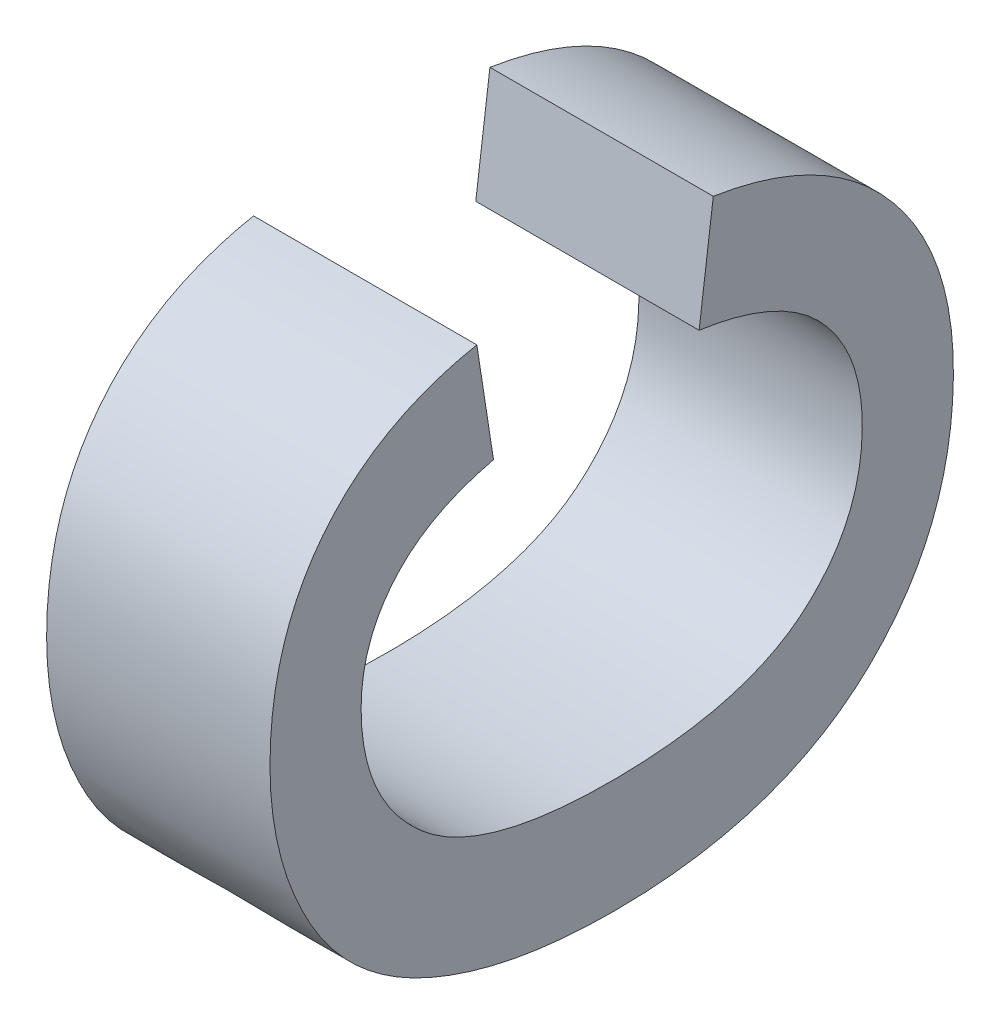
ISO-10303-21;
HEADER;
FILE_DESCRIPTION(('STEP AP214'),'2;1');
FILE_NAME('part.step','',(''),(''),'','','');
FILE_SCHEMA(('AUTOMOTIVE_DESIGN { 1 0 10303 214 1 1 1 1 }'));
ENDSEC;
DATA;
#1=APPLICATION_CONTEXT('core data for automotive mechanical design processes');
#2=APPLICATION_PROTOCOL_DEFINITION('international standard','automotive_design',2000,#1);
#3=PRODUCT_CONTEXT('',#1,'mechanical');
#4=PRODUCT('Part','Part','',(#3));
#5=PRODUCT_RELATED_PRODUCT_CATEGORY('part','',(#4));
#6=PRODUCT_DEFINITION_FORMATION('','',#4);
#7=PRODUCT_DEFINITION_CONTEXT('part definition',#1,'design');
#8=PRODUCT_DEFINITION('design','',#6,#7);
#9=PRODUCT_DEFINITION_SHAPE('','',#8);
#10=(LENGTH_UNIT() NAMED_UNIT(*) SI_UNIT(.MILLI.,.METRE.));
#11=(NAMED_UNIT(*) PLANE_ANGLE_UNIT() SI_UNIT($,.RADIAN.));
#12=(NAMED_UNIT(*) SI_UNIT($,.STERADIAN.) SOLID_ANGLE_UNIT());
#13=UNCERTAINTY_MEASURE_WITH_UNIT(LENGTH_MEASURE(1.E-05),#10,'distance_accuracy_value','');
#14=(GEOMETRIC_REPRESENTATION_CONTEXT(3) GLOBAL_UNCERTAINTY_ASSIGNED_CONTEXT((#13)) GLOBAL_UNIT_ASSIGNED_CONTEXT((#10,
#11,#12)) REPRESENTATION_CONTEXT('',''));
#15=CARTESIAN_POINT('',(0.,0.,0.));
#16=DIRECTION('',(0.,0.,1.));
#17=DIRECTION('',(1.,0.,0.));
#18=AXIS2_PLACEMENT_3D('',#15,#16,#17);
#19=CARTESIAN_POINT('',(4.55229940712888,-37.5062938275421,-8.8544301576874));
#20=DIRECTION('',(-1.,0.,0.));
#21=DIRECTION('',(0.,0.,1.));
#22=AXIS2_PLACEMENT_3D('',#19,#20,#21);
#23=PLANE('',#22);
#24=CARTESIAN_POINT('',(4.55229940712884,-37.2485404965089,-9.00542493597448));
#25=CARTESIAN_POINT('',(4.55229940712884,-37.2726601827609,-9.00914625899622));
#26=CARTESIAN_POINT('',(4.55229940712884,-37.2967798690129,-9.01286758201795));
#27=(BOUNDED_CURVE() B_SPLINE_CURVE(2,(#24,#25,#26),.UNSPECIFIED.,.F.,
.F.) B_SPLINE_CURVE_WITH_KNOTS((3,3),(37.,38.),
.UNSPECIFIED.) CURVE() GEOMETRIC_REPRESENTATION_ITEM() RATIONAL_B_SPLINE_CURVE((1.,1.,1.)) REPRESENTATION_ITEM(''));
#28=CARTESIAN_POINT('',(4.55229940712884,-37.2485404965089,-9.00542493597448));
#29=VERTEX_POINT('',#28);
#30=CARTESIAN_POINT('',(4.55229940712884,-37.2967798690129,-9.01286758201795));
#31=VERTEX_POINT('',#30);
#32=EDGE_CURVE('E68',#29,#31,#27,.T.);
#33=ORIENTED_EDGE('',*,*,#32,.T.);
#34=CARTESIAN_POINT('',(4.55229940712884,-37.2967798690129,-9.01286758201795));
#35=CARTESIAN_POINT('',(4.55229940712885,-37.303671207942,-8.98337265140123));
#36=CARTESIAN_POINT('',(4.55229940712885,-37.321175208822,-8.9684873593143));
#37=CARTESIAN_POINT('',(4.55229940712885,-37.338679209702,-8.95360206722736));
#38=CARTESIAN_POINT('',(4.55229940712885,-37.3634880298469,-8.95360206722736));
#39=CARTESIAN_POINT('',(4.55229940712886,-37.4009769136214,-8.95360206722736));
#40=CARTESIAN_POINT('',(4.55229940712886,-37.4244074659805,-8.980478289051));
#41=CARTESIAN_POINT('',(4.55229940712887,-37.4478380183396,-9.00735451087464));
#42=CARTESIAN_POINT('',(4.55229940712887,-37.4478380183396,-9.06551741143657));
#43=CARTESIAN_POINT('',(4.55229940712887,-37.4478380183396,-9.12450727266999));
#44=CARTESIAN_POINT('',(4.55229940712886,-37.425234426652,-9.15124566771505));
#45=CARTESIAN_POINT('',(4.55229940712886,-37.4026308349644,-9.17798406276011));
#46=CARTESIAN_POINT('',(4.55229940712885,-37.3662445654186,-9.17798406276012));
#47=CARTESIAN_POINT('',(4.55229940712885,-37.337025288359,-9.17798406276011));
#48=CARTESIAN_POINT('',(4.55229940712885,-37.3174538858003,-9.16006658154435));
#49=CARTESIAN_POINT('',(4.55229940712884,-37.2978824832415,-9.14214910032859));
#50=CARTESIAN_POINT('',(4.55229940712884,-37.2926450656554,-9.10493587011124));
#51=(BOUNDED_CURVE() B_SPLINE_CURVE(2,(#34,#35,#36,#37,#38,#39,#40,#41,#42,#43,#44,#45,#46,#47,
#48,#49,#50),.UNSPECIFIED.,.F.,.F.) B_SPLINE_CURVE_WITH_KNOTS((3,2,2,2,2,2,2,2,3),(38.,39.,40.,
41.,42.,43.,44.,45.,46.),
.UNSPECIFIED.) CURVE() GEOMETRIC_REPRESENTATION_ITEM() RATIONAL_B_SPLINE_CURVE((1.,1.,1.,1.,1.,
1.,1.,1.,1.,1.,1.,1.,1.,1.,1.,1.,1.)) REPRESENTATION_ITEM(''));
#52=CARTESIAN_POINT('',(4.55229940712884,-37.2926450656554,-9.10493587011124));
#53=VERTEX_POINT('',#52);
#54=EDGE_CURVE('E108',#31,#53,#51,.T.);
#55=ORIENTED_EDGE('',*,*,#54,.T.);
#56=CARTESIAN_POINT('',(4.55229940712884,-37.2926450656554,-9.10493587011124));
#57=CARTESIAN_POINT('',(4.55229940712884,-37.2682497258462,-9.10810588601865));
#58=CARTESIAN_POINT('',(4.55229940712884,-37.2438543860371,-9.11127590192605));
#59=(BOUNDED_CURVE() B_SPLINE_CURVE(2,(#56,#57,#58),.UNSPECIFIED.,.F.,
.F.) B_SPLINE_CURVE_WITH_KNOTS((3,3),(46.,47.),
.UNSPECIFIED.) CURVE() GEOMETRIC_REPRESENTATION_ITEM() RATIONAL_B_SPLINE_CURVE((1.,1.,1.)) REPRESENTATION_ITEM(''));
#60=CARTESIAN_POINT('',(4.55229940712884,-37.2438543860371,-9.11127590192605));
#61=VERTEX_POINT('',#60);
#62=EDGE_CURVE('E71',#53,#61,#59,.T.);
#63=ORIENTED_EDGE('',*,*,#62,.T.);
#64=CARTESIAN_POINT('',(4.55229940712884,-37.2438543860371,-9.11127590192605));
#65=CARTESIAN_POINT('',(4.55229940712884,-37.2518483391949,-9.16172050288734));
#66=CARTESIAN_POINT('',(4.55229940712884,-37.2847889392762,-9.19025064605398));
#67=CARTESIAN_POINT('',(4.55229940712885,-37.3177295393575,-9.21878078922061));
#68=CARTESIAN_POINT('',(4.55229940712885,-37.3656932583043,-9.21878078922061));
#69=CARTESIAN_POINT('',(4.55229940712886,-37.4257857337664,-9.21878078922061));
#70=CARTESIAN_POINT('',(4.55229940712887,-37.4623098300908,-9.17950015732452));
#71=CARTESIAN_POINT('',(4.55229940712887,-37.4988339264152,-9.14021952542843));
#72=CARTESIAN_POINT('',(4.55229940712887,-37.4988339264152,-9.0668956792224));
#73=CARTESIAN_POINT('',(4.55229940712887,-37.4988339264152,-9.01948326738993));
#74=CARTESIAN_POINT('',(4.55229940712887,-37.4831216736568,-8.98392395851557));
#75=CARTESIAN_POINT('',(4.55229940712887,-37.4674094208983,-8.94836464964121));
#76=CARTESIAN_POINT('',(4.55229940712886,-37.4352957814885,-8.93058499520404));
#77=CARTESIAN_POINT('',(4.55229940712886,-37.4031821420788,-8.91280534076686));
#78=CARTESIAN_POINT('',(4.55229940712885,-37.3654176047471,-8.91280534076686));
#79=CARTESIAN_POINT('',(4.55229940712885,-37.3177295393575,-8.91280534076686));
#80=CARTESIAN_POINT('',(4.55229940712884,-37.2874076480692,-8.93692502701884));
#81=CARTESIAN_POINT('',(4.55229940712884,-37.2570857904301,-8.96104471327083));
#82=CARTESIAN_POINT('',(4.55229940712884,-37.2485404965089,-9.00542493597448));
#83=(BOUNDED_CURVE() B_SPLINE_CURVE(2,(#64,#65,#66,#67,#68,#69,#70,#71,#72,#73,#74,#75,#76,#77,
#78,#79,#80,#81,#82),.UNSPECIFIED.,.F.,.F.) B_SPLINE_CURVE_WITH_KNOTS((3,2,2,2,2,2,2,2,2,3),
(47.,48.,49.,50.,51.,52.,53.,54.,55.,56.),
.UNSPECIFIED.) CURVE() GEOMETRIC_REPRESENTATION_ITEM() RATIONAL_B_SPLINE_CURVE((1.,1.,1.,1.,1.,
1.,1.,1.,1.,1.,1.,1.,1.,1.,1.,1.,1.,1.,1.)) REPRESENTATION_ITEM(''));
#84=EDGE_CURVE('E11',#61,#29,#83,.T.);
#85=ORIENTED_EDGE('',*,*,#84,.T.);
#86=EDGE_LOOP('',(#33,#55,#63,#85));
#87=FACE_BOUND('',#86,.T.);
#88=ADVANCED_FACE('F16',(#87),#23,.T.);
#89=CARTESIAN_POINT('',(4.65229940712888,-37.5062938275421,-8.8544301576874));
#90=DIRECTION('',(1.,0.,0.));
#91=DIRECTION('',(0.,1.,0.));
#92=AXIS2_PLACEMENT_3D('',#89,#90,#91);
#93=PLANE('',#92);
#94=CARTESIAN_POINT('',(4.65229940712884,-37.2438543860371,-9.11127590192605));
#95=CARTESIAN_POINT('',(4.65229940712884,-37.2518483391949,-9.16172050288735));
#96=CARTESIAN_POINT('',(4.65229940712884,-37.2847889392761,-9.19025064605398));
#97=CARTESIAN_POINT('',(4.65229940712885,-37.3177295393574,-9.21878078922061));
#98=CARTESIAN_POINT('',(4.65229940712885,-37.3656932583042,-9.21878078922061));
#99=CARTESIAN_POINT('',(4.65229940712886,-37.4257857337663,-9.21878078922061));
#100=CARTESIAN_POINT('',(4.65229940712887,-37.4623098300908,-9.17950015732453));
#101=CARTESIAN_POINT('',(4.65229940712887,-37.4988339264152,-9.14021952542843));
#102=CARTESIAN_POINT('',(4.65229940712887,-37.4988339264152,-9.0668956792224));
#103=CARTESIAN_POINT('',(4.65229940712887,-37.4988339264152,-9.01948326738993));
#104=CARTESIAN_POINT('',(4.65229940712887,-37.4831216736567,-8.98392395851557));
#105=CARTESIAN_POINT('',(4.65229940712887,-37.4674094208983,-8.94836464964121));
#106=CARTESIAN_POINT('',(4.65229940712887,-37.4352957814885,-8.93058499520404));
#107=CARTESIAN_POINT('',(4.65229940712886,-37.4031821420788,-8.91280534076686));
#108=CARTESIAN_POINT('',(4.65229940712886,-37.3654176047471,-8.91280534076686));
#109=CARTESIAN_POINT('',(4.65229940712885,-37.3177295393574,-8.91280534076686));
#110=CARTESIAN_POINT('',(4.65229940712884,-37.2874076480692,-8.93692502701884));
#111=CARTESIAN_POINT('',(4.65229940712884,-37.2570857904301,-8.96104471327083));
#112=CARTESIAN_POINT('',(4.65229940712884,-37.2485404965089,-9.00542493597448));
#113=(BOUNDED_CURVE() B_SPLINE_CURVE(2,(#94,#95,#96,#97,#98,#99,#100,#101,#102,#103,#104,#105,
#106,#107,#108,#109,#110,#111,#112),.UNSPECIFIED.,.F.,.F.) B_SPLINE_CURVE_WITH_KNOTS((3,2,2,2,2,
2,2,2,2,3),(47.,48.,49.,50.,51.,52.,53.,54.,55.,56.),
.UNSPECIFIED.) CURVE() GEOMETRIC_REPRESENTATION_ITEM() RATIONAL_B_SPLINE_CURVE((1.,1.,1.,1.,1.,
1.,1.,1.,1.,1.,1.,1.,1.,1.,1.,1.,1.,1.,1.)) REPRESENTATION_ITEM(''));
#114=CARTESIAN_POINT('',(4.65229940712884,-37.2438543860371,-9.11127590192605));
#115=VERTEX_POINT('',#114);
#116=CARTESIAN_POINT('',(4.65229940712884,-37.2485404965089,-9.00542493597448));
#117=VERTEX_POINT('',#116);
#118=EDGE_CURVE('E31',#115,#117,#113,.T.);
#119=ORIENTED_EDGE('',*,*,#118,.F.);
#120=CARTESIAN_POINT('',(4.65229940712884,-37.2926450656554,-9.10493587011124));
#121=CARTESIAN_POINT('',(4.65229940712884,-37.2682497258462,-9.10810588601865));
#122=CARTESIAN_POINT('',(4.65229940712884,-37.2438543860371,-9.11127590192605));
#123=(BOUNDED_CURVE() B_SPLINE_CURVE(2,(#120,#121,#122),.UNSPECIFIED.,.F.,
.F.) B_SPLINE_CURVE_WITH_KNOTS((3,3),(46.,47.),
.UNSPECIFIED.) CURVE() GEOMETRIC_REPRESENTATION_ITEM() RATIONAL_B_SPLINE_CURVE((1.,1.,1.)) REPRESENTATION_ITEM(''));
#124=CARTESIAN_POINT('',(4.65229940712884,-37.2926450656554,-9.10493587011124));
#125=VERTEX_POINT('',#124);
#126=EDGE_CURVE('E115',#125,#115,#123,.T.);
#127=ORIENTED_EDGE('',*,*,#126,.F.);
#128=CARTESIAN_POINT('',(4.65229940712885,-37.2967798690128,-9.01286758201795));
#129=CARTESIAN_POINT('',(4.65229940712885,-37.303671207942,-8.98337265140124));
#130=CARTESIAN_POINT('',(4.65229940712885,-37.321175208822,-8.9684873593143));
#131=CARTESIAN_POINT('',(4.65229940712885,-37.338679209702,-8.95360206722737));
#132=CARTESIAN_POINT('',(4.65229940712886,-37.3634880298469,-8.95360206722737));
#133=CARTESIAN_POINT('',(4.65229940712886,-37.4009769136214,-8.95360206722737));
#134=CARTESIAN_POINT('',(4.65229940712886,-37.4244074659805,-8.980478289051));
#135=CARTESIAN_POINT('',(4.65229940712887,-37.4478380183395,-9.00735451087464));
#136=CARTESIAN_POINT('',(4.65229940712887,-37.4478380183396,-9.06551741143657));
#137=CARTESIAN_POINT('',(4.65229940712887,-37.4478380183395,-9.12450727267));
#138=CARTESIAN_POINT('',(4.65229940712886,-37.425234426652,-9.15124566771505));
#139=CARTESIAN_POINT('',(4.65229940712886,-37.4026308349644,-9.17798406276011));
#140=CARTESIAN_POINT('',(4.65229940712885,-37.3662445654186,-9.17798406276012));
#141=CARTESIAN_POINT('',(4.65229940712885,-37.337025288359,-9.17798406276011));
#142=CARTESIAN_POINT('',(4.65229940712885,-37.3174538858003,-9.16006658154435));
#143=CARTESIAN_POINT('',(4.65229940712884,-37.2978824832415,-9.14214910032859));
#144=CARTESIAN_POINT('',(4.65229940712884,-37.2926450656554,-9.10493587011124));
#145=(BOUNDED_CURVE() B_SPLINE_CURVE(2,(#128,#129,#130,#131,#132,#133,#134,#135,#136,#137,#138,
#139,#140,#141,#142,#143,#144),.UNSPECIFIED.,.F.,.F.) B_SPLINE_CURVE_WITH_KNOTS((3,2,2,2,2,2,2,
2,3),(38.,39.,40.,41.,42.,43.,44.,45.,46.),
.UNSPECIFIED.) CURVE() GEOMETRIC_REPRESENTATION_ITEM() RATIONAL_B_SPLINE_CURVE((1.,1.,1.,1.,1.,
1.,1.,1.,1.,1.,1.,1.,1.,1.,1.,1.,1.)) REPRESENTATION_ITEM(''));
#146=CARTESIAN_POINT('',(4.65229940712885,-37.2967798690128,-9.01286758201795));
#147=VERTEX_POINT('',#146);
#148=EDGE_CURVE('E81',#147,#125,#145,.T.);
#149=ORIENTED_EDGE('',*,*,#148,.F.);
#150=CARTESIAN_POINT('',(4.65229940712884,-37.2485404965089,-9.00542493597448));
#151=CARTESIAN_POINT('',(4.65229940712884,-37.2726601827609,-9.00914625899622));
#152=CARTESIAN_POINT('',(4.65229940712885,-37.2967798690128,-9.01286758201795));
#153=(BOUNDED_CURVE() B_SPLINE_CURVE(2,(#150,#151,#152),.UNSPECIFIED.,.F.,
.F.) B_SPLINE_CURVE_WITH_KNOTS((3,3),(37.,38.),
.UNSPECIFIED.) CURVE() GEOMETRIC_REPRESENTATION_ITEM() RATIONAL_B_SPLINE_CURVE((1.,1.,1.)) REPRESENTATION_ITEM(''));
#154=EDGE_CURVE('E92',#117,#147,#153,.T.);
#155=ORIENTED_EDGE('',*,*,#154,.F.);
#156=EDGE_LOOP('',(#119,#127,#149,#155));
#157=FACE_BOUND('',#156,.T.);
#158=ADVANCED_FACE('F174',(#157),#93,.T.);
#159=CARTESIAN_POINT('',(4.65229940712884,-37.2438543860371,-9.11127590192605));
#160=CARTESIAN_POINT('',(4.55229940712884,-37.2438543860371,-9.11127590192605));
#161=CARTESIAN_POINT('',(4.65229940712884,-37.2518483391949,-9.16172050288735));
#162=CARTESIAN_POINT('',(4.55229940712884,-37.2518483391949,-9.16172050288734));
#163=CARTESIAN_POINT('',(4.65229940712884,-37.2847889392761,-9.19025064605398));
#164=CARTESIAN_POINT('',(4.55229940712884,-37.2847889392762,-9.19025064605398));
#165=CARTESIAN_POINT('',(4.65229940712885,-37.3177295393574,-9.21878078922061));
#166=CARTESIAN_POINT('',(4.55229940712885,-37.3177295393575,-9.21878078922061));
#167=CARTESIAN_POINT('',(4.65229940712885,-37.3656932583042,-9.21878078922061));
#168=CARTESIAN_POINT('',(4.55229940712885,-37.3656932583043,-9.21878078922061));
#169=CARTESIAN_POINT('',(4.65229940712886,-37.4257857337663,-9.21878078922061));
#170=CARTESIAN_POINT('',(4.55229940712886,-37.4257857337664,-9.21878078922061));
#171=CARTESIAN_POINT('',(4.65229940712887,-37.4623098300908,-9.17950015732453));
#172=CARTESIAN_POINT('',(4.55229940712887,-37.4623098300908,-9.17950015732452));
#173=CARTESIAN_POINT('',(4.65229940712887,-37.4988339264152,-9.14021952542843));
#174=CARTESIAN_POINT('',(4.55229940712887,-37.4988339264152,-9.14021952542843));
#175=CARTESIAN_POINT('',(4.65229940712887,-37.4988339264152,-9.0668956792224));
#176=CARTESIAN_POINT('',(4.55229940712887,-37.4988339264152,-9.0668956792224));
#177=CARTESIAN_POINT('',(4.65229940712887,-37.4988339264152,-9.01948326738993));
#178=CARTESIAN_POINT('',(4.55229940712887,-37.4988339264152,-9.01948326738993));
#179=CARTESIAN_POINT('',(4.65229940712887,-37.4831216736567,-8.98392395851557));
#180=CARTESIAN_POINT('',(4.55229940712887,-37.4831216736568,-8.98392395851557));
#181=CARTESIAN_POINT('',(4.65229940712887,-37.4674094208983,-8.94836464964121));
#182=CARTESIAN_POINT('',(4.55229940712887,-37.4674094208983,-8.94836464964121));
#183=CARTESIAN_POINT('',(4.65229940712887,-37.4352957814885,-8.93058499520404));
#184=CARTESIAN_POINT('',(4.55229940712886,-37.4352957814885,-8.93058499520404));
#185=CARTESIAN_POINT('',(4.65229940712886,-37.4031821420788,-8.91280534076686));
#186=CARTESIAN_POINT('',(4.55229940712886,-37.4031821420788,-8.91280534076686));
#187=CARTESIAN_POINT('',(4.65229940712886,-37.3654176047471,-8.91280534076686));
#188=CARTESIAN_POINT('',(4.55229940712885,-37.3654176047471,-8.91280534076686));
#189=CARTESIAN_POINT('',(4.65229940712885,-37.3177295393574,-8.91280534076686));
#190=CARTESIAN_POINT('',(4.55229940712885,-37.3177295393575,-8.91280534076686));
#191=CARTESIAN_POINT('',(4.65229940712884,-37.2874076480692,-8.93692502701884));
#192=CARTESIAN_POINT('',(4.55229940712884,-37.2874076480692,-8.93692502701884));
#193=CARTESIAN_POINT('',(4.65229940712884,-37.2570857904301,-8.96104471327083));
#194=CARTESIAN_POINT('',(4.55229940712884,-37.2570857904301,-8.96104471327083));
#195=CARTESIAN_POINT('',(4.65229940712884,-37.2485404965089,-9.00542493597448));
#196=CARTESIAN_POINT('',(4.55229940712884,-37.2485404965089,-9.00542493597448));
#197=(BOUNDED_SURFACE() B_SPLINE_SURFACE(2,1,((#159,#160),(#161,#162),(#163,#164),(#165,#166),
(#167,#168),(#169,#170),(#171,#172),(#173,#174),(#175,#176),(#177,#178),(#179,#180),(#181,#182),
(#183,#184),(#185,#186),(#187,#188),(#189,#190),(#191,#192),(#193,#194),(#195,#196)),
.UNSPECIFIED.,.F.,.F.,.F.) B_SPLINE_SURFACE_WITH_KNOTS((3,2,2,2,2,2,2,2,2,3),(2,2),(47.,48.,49.,
50.,51.,52.,53.,54.,55.,56.),(0.,0.1),
.UNSPECIFIED.) GEOMETRIC_REPRESENTATION_ITEM() RATIONAL_B_SPLINE_SURFACE(((1.,1.),(1.,1.),(1.,
1.),(1.,1.),(1.,1.),(1.,1.),(1.,1.),(1.,1.),(1.,1.),(1.,1.),(1.,1.),(1.,1.),(1.,1.),(1.,1.),(1.,
1.),(1.,1.),(1.,1.),(1.,1.),(1.,1.))) REPRESENTATION_ITEM('') SURFACE());
#198=CARTESIAN_POINT('',(4.65229940712884,-37.2485404965089,-9.00542493597448));
#199=CARTESIAN_POINT('',(4.55229940712884,-37.2485404965089,-9.00542493597448));
#200=(BOUNDED_CURVE() B_SPLINE_CURVE(1,(#198,#199),.UNSPECIFIED.,.F.,
.F.) B_SPLINE_CURVE_WITH_KNOTS((2,2),(0.,0.1),
.UNSPECIFIED.) CURVE() GEOMETRIC_REPRESENTATION_ITEM() RATIONAL_B_SPLINE_CURVE((1.,1.)) REPRESENTATION_ITEM(''));
#201=EDGE_CURVE('E75',#117,#29,#200,.T.);
#202=CARTESIAN_POINT('',(4.65229940712884,-37.2438543860371,-9.11127590192605));
#203=CARTESIAN_POINT('',(4.55229940712884,-37.2438543860371,-9.11127590192605));
#204=(BOUNDED_CURVE() B_SPLINE_CURVE(1,(#202,#203),.UNSPECIFIED.,.F.,
.F.) B_SPLINE_CURVE_WITH_KNOTS((2,2),(0.,0.1),
.UNSPECIFIED.) CURVE() GEOMETRIC_REPRESENTATION_ITEM() RATIONAL_B_SPLINE_CURVE((1.,1.)) REPRESENTATION_ITEM(''));
#205=EDGE_CURVE('E22',#115,#61,#204,.T.);
#206=ORIENTED_EDGE('',*,*,#118,.T.);
#207=ORIENTED_EDGE('',*,*,#201,.T.);
#208=ORIENTED_EDGE('',*,*,#84,.F.);
#209=ORIENTED_EDGE('',*,*,#205,.F.);
#210=EDGE_LOOP('',(#206,#207,#208,#209));
#211=FACE_BOUND('',#210,.T.);
#212=ADVANCED_FACE('F76',(#211),#197,.T.);
#213=CARTESIAN_POINT('',(4.65229940712884,-37.2926450656554,-9.10493587011124));
#214=CARTESIAN_POINT('',(4.55229940712884,-37.2926450656554,-9.10493587011124));
#215=CARTESIAN_POINT('',(4.65229940712884,-37.2682497258462,-9.10810588601865));
#216=CARTESIAN_POINT('',(4.55229940712884,-37.2682497258462,-9.10810588601865));
#217=CARTESIAN_POINT('',(4.65229940712884,-37.2438543860371,-9.11127590192605));
#218=CARTESIAN_POINT('',(4.55229940712884,-37.2438543860371,-9.11127590192605));
#219=(BOUNDED_SURFACE() B_SPLINE_SURFACE(2,1,((#213,#214),(#215,#216),(#217,#218)),
.UNSPECIFIED.,.F.,.F.,.F.) B_SPLINE_SURFACE_WITH_KNOTS((3,3),(2,2),(46.,47.),(0.,0.1),
.UNSPECIFIED.) GEOMETRIC_REPRESENTATION_ITEM() RATIONAL_B_SPLINE_SURFACE(((1.,1.),(1.,1.),(1.,1.))) REPRESENTATION_ITEM('') SURFACE());
#220=CARTESIAN_POINT('',(4.65229940712884,-37.2926450656554,-9.10493587011124));
#221=CARTESIAN_POINT('',(4.55229940712884,-37.2926450656554,-9.10493587011124));
#222=(BOUNDED_CURVE() B_SPLINE_CURVE(1,(#220,#221),.UNSPECIFIED.,.F.,
.F.) B_SPLINE_CURVE_WITH_KNOTS((2,2),(0.,0.1),
.UNSPECIFIED.) CURVE() GEOMETRIC_REPRESENTATION_ITEM() RATIONAL_B_SPLINE_CURVE((1.,1.)) REPRESENTATION_ITEM(''));
#223=EDGE_CURVE('E98',#125,#53,#222,.T.);
#224=ORIENTED_EDGE('',*,*,#126,.T.);
#225=ORIENTED_EDGE('',*,*,#205,.T.);
#226=ORIENTED_EDGE('',*,*,#62,.F.);
#227=ORIENTED_EDGE('',*,*,#223,.F.);
#228=EDGE_LOOP('',(#224,#225,#226,#227));
#229=FACE_BOUND('',#228,.T.);
#230=ADVANCED_FACE('F131',(#229),#219,.T.);
#231=CARTESIAN_POINT('',(4.65229940712885,-37.2967798690128,-9.01286758201795));
#232=CARTESIAN_POINT('',(4.55229940712884,-37.2967798690129,-9.01286758201795));
#233=CARTESIAN_POINT('',(4.65229940712885,-37.303671207942,-8.98337265140124));
#234=CARTESIAN_POINT('',(4.55229940712885,-37.303671207942,-8.98337265140123));
#235=CARTESIAN_POINT('',(4.65229940712885,-37.321175208822,-8.9684873593143));
#236=CARTESIAN_POINT('',(4.55229940712885,-37.321175208822,-8.9684873593143));
#237=CARTESIAN_POINT('',(4.65229940712885,-37.338679209702,-8.95360206722737));
#238=CARTESIAN_POINT('',(4.55229940712885,-37.338679209702,-8.95360206722736));
#239=CARTESIAN_POINT('',(4.65229940712886,-37.3634880298469,-8.95360206722737));
#240=CARTESIAN_POINT('',(4.55229940712885,-37.3634880298469,-8.95360206722736));
#241=CARTESIAN_POINT('',(4.65229940712886,-37.4009769136214,-8.95360206722737));
#242=CARTESIAN_POINT('',(4.55229940712886,-37.4009769136214,-8.95360206722736));
#243=CARTESIAN_POINT('',(4.65229940712886,-37.4244074659805,-8.980478289051));
#244=CARTESIAN_POINT('',(4.55229940712886,-37.4244074659805,-8.980478289051));
#245=CARTESIAN_POINT('',(4.65229940712887,-37.4478380183395,-9.00735451087464));
#246=CARTESIAN_POINT('',(4.55229940712887,-37.4478380183396,-9.00735451087464));
#247=CARTESIAN_POINT('',(4.65229940712887,-37.4478380183396,-9.06551741143657));
#248=CARTESIAN_POINT('',(4.55229940712887,-37.4478380183396,-9.06551741143657));
#249=CARTESIAN_POINT('',(4.65229940712887,-37.4478380183395,-9.12450727267));
#250=CARTESIAN_POINT('',(4.55229940712887,-37.4478380183396,-9.12450727266999));
#251=CARTESIAN_POINT('',(4.65229940712886,-37.425234426652,-9.15124566771505));
#252=CARTESIAN_POINT('',(4.55229940712886,-37.425234426652,-9.15124566771505));
#253=CARTESIAN_POINT('',(4.65229940712886,-37.4026308349644,-9.17798406276011));
#254=CARTESIAN_POINT('',(4.55229940712886,-37.4026308349644,-9.17798406276011));
#255=CARTESIAN_POINT('',(4.65229940712885,-37.3662445654186,-9.17798406276012));
#256=CARTESIAN_POINT('',(4.55229940712885,-37.3662445654186,-9.17798406276012));
#257=CARTESIAN_POINT('',(4.65229940712885,-37.337025288359,-9.17798406276011));
#258=CARTESIAN_POINT('',(4.55229940712885,-37.337025288359,-9.17798406276011));
#259=CARTESIAN_POINT('',(4.65229940712885,-37.3174538858003,-9.16006658154435));
#260=CARTESIAN_POINT('',(4.55229940712885,-37.3174538858003,-9.16006658154435));
#261=CARTESIAN_POINT('',(4.65229940712884,-37.2978824832415,-9.14214910032859));
#262=CARTESIAN_POINT('',(4.55229940712884,-37.2978824832415,-9.14214910032859));
#263=CARTESIAN_POINT('',(4.65229940712884,-37.2926450656554,-9.10493587011124));
#264=CARTESIAN_POINT('',(4.55229940712884,-37.2926450656554,-9.10493587011124));
#265=(BOUNDED_SURFACE() B_SPLINE_SURFACE(2,1,((#231,#232),(#233,#234),(#235,#236),(#237,#238),
(#239,#240),(#241,#242),(#243,#244),(#245,#246),(#247,#248),(#249,#250),(#251,#252),(#253,#254),
(#255,#256),(#257,#258),(#259,#260),(#261,#262),(#263,#264)),.UNSPECIFIED.,.F.,.F.,
.F.) B_SPLINE_SURFACE_WITH_KNOTS((3,2,2,2,2,2,2,2,3),(2,2),(38.,39.,40.,41.,42.,43.,44.,45.,
46.),(0.,0.1),.UNSPECIFIED.) GEOMETRIC_REPRESENTATION_ITEM() RATIONAL_B_SPLINE_SURFACE(((1.,1.),
(1.,1.),(1.,1.),(1.,1.),(1.,1.),(1.,1.),(1.,1.),(1.,1.),(1.,1.),(1.,1.),(1.,1.),(1.,1.),(1.,1.),
(1.,1.),(1.,1.),(1.,1.),(1.,1.))) REPRESENTATION_ITEM('') SURFACE());
#266=CARTESIAN_POINT('',(4.65229940712885,-37.2967798690128,-9.01286758201795));
#267=CARTESIAN_POINT('',(4.55229940712884,-37.2967798690129,-9.01286758201795));
#268=(BOUNDED_CURVE() B_SPLINE_CURVE(1,(#266,#267),.UNSPECIFIED.,.F.,
.F.) B_SPLINE_CURVE_WITH_KNOTS((2,2),(0.,0.1),
.UNSPECIFIED.) CURVE() GEOMETRIC_REPRESENTATION_ITEM() RATIONAL_B_SPLINE_CURVE((1.,1.)) REPRESENTATION_ITEM(''));
#269=EDGE_CURVE('E85',#147,#31,#268,.T.);
#270=ORIENTED_EDGE('',*,*,#148,.T.);
#271=ORIENTED_EDGE('',*,*,#223,.T.);
#272=ORIENTED_EDGE('',*,*,#54,.F.);
#273=ORIENTED_EDGE('',*,*,#269,.F.);
#274=EDGE_LOOP('',(#270,#271,#272,#273));
#275=FACE_BOUND('',#274,.T.);
#276=ADVANCED_FACE('F18',(#275),#265,.T.);
#277=CARTESIAN_POINT('',(4.65229940712884,-37.2485404965089,-9.00542493597448));
#278=CARTESIAN_POINT('',(4.55229940712884,-37.2485404965089,-9.00542493597448));
#279=CARTESIAN_POINT('',(4.65229940712884,-37.2726601827609,-9.00914625899622));
#280=CARTESIAN_POINT('',(4.55229940712884,-37.2726601827609,-9.00914625899622));
#281=CARTESIAN_POINT('',(4.65229940712885,-37.2967798690128,-9.01286758201795));
#282=CARTESIAN_POINT('',(4.55229940712884,-37.2967798690129,-9.01286758201795));
#283=(BOUNDED_SURFACE() B_SPLINE_SURFACE(2,1,((#277,#278),(#279,#280),(#281,#282)),
.UNSPECIFIED.,.F.,.F.,.F.) B_SPLINE_SURFACE_WITH_KNOTS((3,3),(2,2),(37.,38.),(0.,0.1),
.UNSPECIFIED.) GEOMETRIC_REPRESENTATION_ITEM() RATIONAL_B_SPLINE_SURFACE(((1.,1.),(1.,1.),(1.,1.))) REPRESENTATION_ITEM('') SURFACE());
#284=ORIENTED_EDGE('',*,*,#154,.T.);
#285=ORIENTED_EDGE('',*,*,#269,.T.);
#286=ORIENTED_EDGE('',*,*,#32,.F.);
#287=ORIENTED_EDGE('',*,*,#201,.F.);
#288=EDGE_LOOP('',(#284,#285,#286,#287));
#289=FACE_BOUND('',#288,.T.);
#290=ADVANCED_FACE('F83',(#289),#283,.T.);
#291=CLOSED_SHELL('',(#88,#158,#212,#230,#276,#290));
#292=MANIFOLD_SOLID_BREP('B1',#291);
#293=ADVANCED_BREP_SHAPE_REPRESENTATION('',(#18,#292),#14);
#294=SHAPE_DEFINITION_REPRESENTATION(#9,#293);
ENDSEC;
END-ISO-10303-21;
